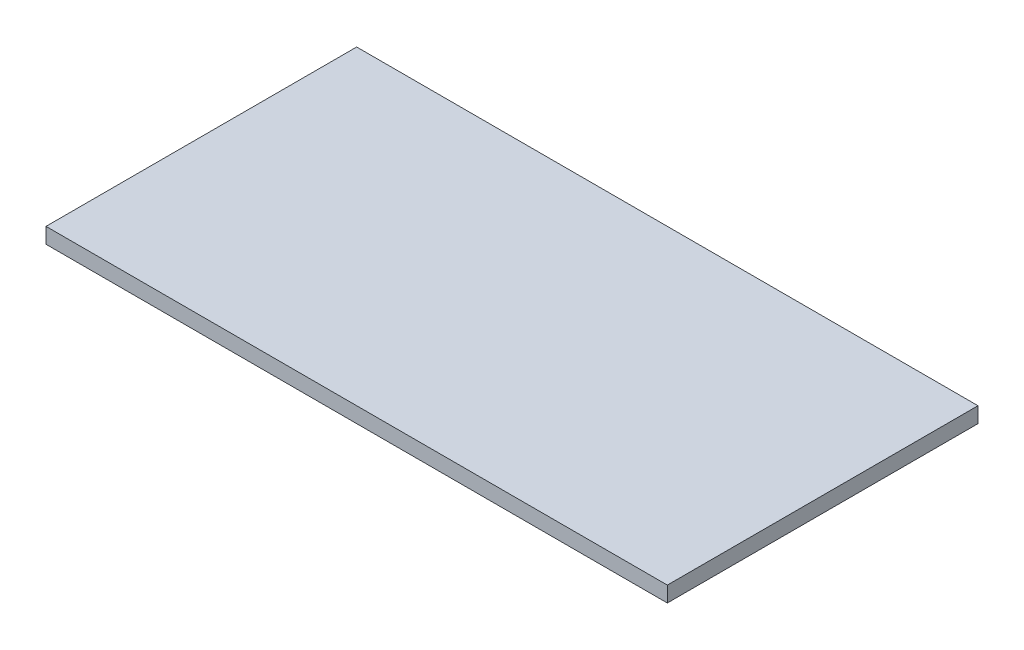
ISO-10303-21;
HEADER;
FILE_DESCRIPTION(('STEP AP214'),'2;1');
FILE_NAME('part.step','',(''),(''),'','','');
FILE_SCHEMA(('AUTOMOTIVE_DESIGN { 1 0 10303 214 1 1 1 1 }'));
ENDSEC;
DATA;
#1=APPLICATION_CONTEXT('core data for automotive mechanical design processes');
#2=APPLICATION_PROTOCOL_DEFINITION('international standard','automotive_design',2000,#1);
#3=PRODUCT_CONTEXT('',#1,'mechanical');
#4=PRODUCT('Part','Part','',(#3));
#5=PRODUCT_RELATED_PRODUCT_CATEGORY('part','',(#4));
#6=PRODUCT_DEFINITION_FORMATION('','',#4);
#7=PRODUCT_DEFINITION_CONTEXT('part definition',#1,'design');
#8=PRODUCT_DEFINITION('design','',#6,#7);
#9=PRODUCT_DEFINITION_SHAPE('','',#8);
#10=(LENGTH_UNIT() NAMED_UNIT(*) SI_UNIT(.MILLI.,.METRE.));
#11=(NAMED_UNIT(*) PLANE_ANGLE_UNIT() SI_UNIT($,.RADIAN.));
#12=(NAMED_UNIT(*) SI_UNIT($,.STERADIAN.) SOLID_ANGLE_UNIT());
#13=UNCERTAINTY_MEASURE_WITH_UNIT(LENGTH_MEASURE(1.E-05),#10,'distance_accuracy_value','');
#14=(GEOMETRIC_REPRESENTATION_CONTEXT(3) GLOBAL_UNCERTAINTY_ASSIGNED_CONTEXT((#13)) GLOBAL_UNIT_ASSIGNED_CONTEXT((#10,
#11,#12)) REPRESENTATION_CONTEXT('',''));
#15=CARTESIAN_POINT('',(0.,0.,0.));
#16=DIRECTION('',(0.,0.,1.));
#17=DIRECTION('',(1.,0.,0.));
#18=AXIS2_PLACEMENT_3D('',#15,#16,#17);
#19=CARTESIAN_POINT('',(-127.,6.35,63.5));
#20=DIRECTION('',(1.,0.,0.));
#21=DIRECTION('',(0.,0.,-1.));
#22=AXIS2_PLACEMENT_3D('',#19,#20,#21);
#23=PLANE('',#22);
#24=DIRECTION('',(0.,0.,1.));
#25=VECTOR('',#24,1.);
#26=CARTESIAN_POINT('',(-127.,0.,63.5));
#27=LINE('',#26,#25);
#28=CARTESIAN_POINT('',(-127.,0.,-63.5));
#29=VERTEX_POINT('',#28);
#30=CARTESIAN_POINT('',(-127.,0.,63.5));
#31=VERTEX_POINT('',#30);
#32=EDGE_CURVE('E99',#29,#31,#27,.T.);
#33=ORIENTED_EDGE('',*,*,#32,.T.);
#34=DIRECTION('',(0.,-1.,0.));
#35=VECTOR('',#34,1.);
#36=CARTESIAN_POINT('',(-127.,6.35,63.5));
#37=LINE('',#36,#35);
#38=CARTESIAN_POINT('',(-127.,6.35,63.5));
#39=VERTEX_POINT('',#38);
#40=EDGE_CURVE('E11',#39,#31,#37,.T.);
#41=ORIENTED_EDGE('',*,*,#40,.F.);
#42=DIRECTION('',(0.,0.,1.));
#43=VECTOR('',#42,1.);
#44=CARTESIAN_POINT('',(-127.,6.35,63.5));
#45=LINE('',#44,#43);
#46=CARTESIAN_POINT('',(-127.,6.35,-63.5));
#47=VERTEX_POINT('',#46);
#48=EDGE_CURVE('E87',#47,#39,#45,.T.);
#49=ORIENTED_EDGE('',*,*,#48,.F.);
#50=DIRECTION('',(0.,-1.,0.));
#51=VECTOR('',#50,1.);
#52=CARTESIAN_POINT('',(-127.,6.35,-63.5));
#53=LINE('',#52,#51);
#54=EDGE_CURVE('E95',#47,#29,#53,.T.);
#55=ORIENTED_EDGE('',*,*,#54,.T.);
#56=EDGE_LOOP('',(#33,#41,#49,#55));
#57=FACE_BOUND('',#56,.T.);
#58=ADVANCED_FACE('F36',(#57),#23,.F.);
#59=CARTESIAN_POINT('',(127.,6.35,63.5));
#60=DIRECTION('',(0.,0.,-1.));
#61=DIRECTION('',(-1.,0.,0.));
#62=AXIS2_PLACEMENT_3D('',#59,#60,#61);
#63=PLANE('',#62);
#64=DIRECTION('',(1.,0.,0.));
#65=VECTOR('',#64,1.);
#66=CARTESIAN_POINT('',(127.,0.,63.5));
#67=LINE('',#66,#65);
#68=CARTESIAN_POINT('',(127.,0.,63.5));
#69=VERTEX_POINT('',#68);
#70=EDGE_CURVE('E91',#31,#69,#67,.T.);
#71=ORIENTED_EDGE('',*,*,#70,.T.);
#72=DIRECTION('',(0.,-1.,0.));
#73=VECTOR('',#72,1.);
#74=CARTESIAN_POINT('',(127.,6.35,63.5));
#75=LINE('',#74,#73);
#76=CARTESIAN_POINT('',(127.,6.35,63.5));
#77=VERTEX_POINT('',#76);
#78=EDGE_CURVE('E44',#77,#69,#75,.T.);
#79=ORIENTED_EDGE('',*,*,#78,.F.);
#80=DIRECTION('',(1.,0.,0.));
#81=VECTOR('',#80,1.);
#82=CARTESIAN_POINT('',(127.,6.35,63.5));
#83=LINE('',#82,#81);
#84=EDGE_CURVE('E82',#39,#77,#83,.T.);
#85=ORIENTED_EDGE('',*,*,#84,.F.);
#86=ORIENTED_EDGE('',*,*,#40,.T.);
#87=EDGE_LOOP('',(#71,#79,#85,#86));
#88=FACE_BOUND('',#87,.T.);
#89=ADVANCED_FACE('F90',(#88),#63,.F.);
#90=CARTESIAN_POINT('',(127.,6.35,63.5));
#91=DIRECTION('',(-1.,0.,0.));
#92=DIRECTION('',(0.,0.,1.));
#93=AXIS2_PLACEMENT_3D('',#90,#91,#92);
#94=PLANE('',#93);
#95=DIRECTION('',(0.,0.,-1.));
#96=VECTOR('',#95,1.);
#97=CARTESIAN_POINT('',(127.,0.,63.5));
#98=LINE('',#97,#96);
#99=CARTESIAN_POINT('',(127.,0.,-63.5));
#100=VERTEX_POINT('',#99);
#101=EDGE_CURVE('E69',#69,#100,#98,.T.);
#102=ORIENTED_EDGE('',*,*,#101,.T.);
#103=DIRECTION('',(0.,-1.,0.));
#104=VECTOR('',#103,1.);
#105=CARTESIAN_POINT('',(127.,6.35,-63.5));
#106=LINE('',#105,#104);
#107=CARTESIAN_POINT('',(127.,6.35,-63.5));
#108=VERTEX_POINT('',#107);
#109=EDGE_CURVE('E92',#108,#100,#106,.T.);
#110=ORIENTED_EDGE('',*,*,#109,.F.);
#111=DIRECTION('',(0.,0.,-1.));
#112=VECTOR('',#111,1.);
#113=CARTESIAN_POINT('',(127.,6.35,63.5));
#114=LINE('',#113,#112);
#115=EDGE_CURVE('E85',#77,#108,#114,.T.);
#116=ORIENTED_EDGE('',*,*,#115,.F.);
#117=ORIENTED_EDGE('',*,*,#78,.T.);
#118=EDGE_LOOP('',(#102,#110,#116,#117));
#119=FACE_BOUND('',#118,.T.);
#120=ADVANCED_FACE('F93',(#119),#94,.F.);
#121=CARTESIAN_POINT('',(127.,6.35,-63.5));
#122=DIRECTION('',(0.,0.,1.));
#123=DIRECTION('',(1.,0.,0.));
#124=AXIS2_PLACEMENT_3D('',#121,#122,#123);
#125=PLANE('',#124);
#126=DIRECTION('',(-1.,0.,0.));
#127=VECTOR('',#126,1.);
#128=CARTESIAN_POINT('',(127.,0.,-63.5));
#129=LINE('',#128,#127);
#130=EDGE_CURVE('E75',#100,#29,#129,.T.);
#131=ORIENTED_EDGE('',*,*,#130,.T.);
#132=ORIENTED_EDGE('',*,*,#54,.F.);
#133=DIRECTION('',(-1.,0.,0.));
#134=VECTOR('',#133,1.);
#135=CARTESIAN_POINT('',(127.,6.35,-63.5));
#136=LINE('',#135,#134);
#137=EDGE_CURVE('E52',#108,#47,#136,.T.);
#138=ORIENTED_EDGE('',*,*,#137,.F.);
#139=ORIENTED_EDGE('',*,*,#109,.T.);
#140=EDGE_LOOP('',(#131,#132,#138,#139));
#141=FACE_BOUND('',#140,.T.);
#142=ADVANCED_FACE('F106',(#141),#125,.F.);
#143=CARTESIAN_POINT('',(0.,6.35,0.));
#144=DIRECTION('',(0.,1.,0.));
#145=DIRECTION('',(0.,0.,1.));
#146=AXIS2_PLACEMENT_3D('',#143,#144,#145);
#147=PLANE('',#146);
#148=ORIENTED_EDGE('',*,*,#48,.T.);
#149=ORIENTED_EDGE('',*,*,#84,.T.);
#150=ORIENTED_EDGE('',*,*,#115,.T.);
#151=ORIENTED_EDGE('',*,*,#137,.T.);
#152=EDGE_LOOP('',(#148,#149,#150,#151));
#153=FACE_BOUND('',#152,.T.);
#154=ADVANCED_FACE('F83',(#153),#147,.T.);
#155=CARTESIAN_POINT('',(0.,0.,0.));
#156=DIRECTION('',(0.,1.,0.));
#157=DIRECTION('',(0.,0.,1.));
#158=AXIS2_PLACEMENT_3D('',#155,#156,#157);
#159=PLANE('',#158);
#160=ORIENTED_EDGE('',*,*,#32,.F.);
#161=ORIENTED_EDGE('',*,*,#130,.F.);
#162=ORIENTED_EDGE('',*,*,#101,.F.);
#163=ORIENTED_EDGE('',*,*,#70,.F.);
#164=EDGE_LOOP('',(#160,#161,#162,#163));
#165=FACE_BOUND('',#164,.T.);
#166=ADVANCED_FACE('F109',(#165),#159,.F.);
#167=CLOSED_SHELL('',(#58,#89,#120,#142,#154,#166));
#168=MANIFOLD_SOLID_BREP('B2',#167);
#169=ADVANCED_BREP_SHAPE_REPRESENTATION('',(#18,#168),#14);
#170=SHAPE_DEFINITION_REPRESENTATION(#9,#169);
ENDSEC;
END-ISO-10303-21;
